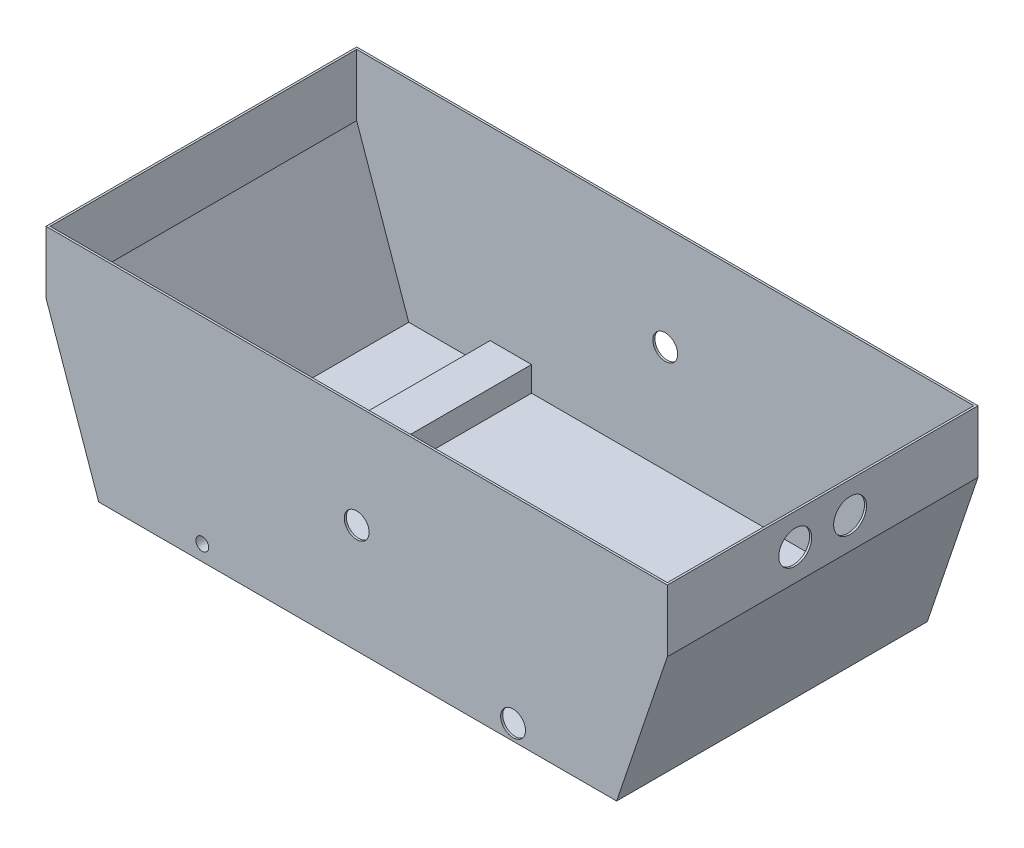
ISO-10303-21;
HEADER;
FILE_DESCRIPTION(('STEP AP214'),'2;1');
FILE_NAME('part.step','',(''),(''),'','','');
FILE_SCHEMA(('AUTOMOTIVE_DESIGN { 1 0 10303 214 1 1 1 1 }'));
ENDSEC;
DATA;
#1=APPLICATION_CONTEXT('core data for automotive mechanical design processes');
#2=APPLICATION_PROTOCOL_DEFINITION('international standard','automotive_design',2000,#1);
#3=PRODUCT_CONTEXT('',#1,'mechanical');
#4=PRODUCT('Part','Part','',(#3));
#5=PRODUCT_RELATED_PRODUCT_CATEGORY('part','',(#4));
#6=PRODUCT_DEFINITION_FORMATION('','',#4);
#7=PRODUCT_DEFINITION_CONTEXT('part definition',#1,'design');
#8=PRODUCT_DEFINITION('design','',#6,#7);
#9=PRODUCT_DEFINITION_SHAPE('','',#8);
#10=(LENGTH_UNIT() NAMED_UNIT(*) SI_UNIT(.MILLI.,.METRE.));
#11=(NAMED_UNIT(*) PLANE_ANGLE_UNIT() SI_UNIT($,.RADIAN.));
#12=(NAMED_UNIT(*) SI_UNIT($,.STERADIAN.) SOLID_ANGLE_UNIT());
#13=UNCERTAINTY_MEASURE_WITH_UNIT(LENGTH_MEASURE(1.E-05),#10,'distance_accuracy_value','');
#14=(GEOMETRIC_REPRESENTATION_CONTEXT(3) GLOBAL_UNCERTAINTY_ASSIGNED_CONTEXT((#13)) GLOBAL_UNIT_ASSIGNED_CONTEXT((#10,
#11,#12)) REPRESENTATION_CONTEXT('',''));
#15=CARTESIAN_POINT('',(0.,0.,0.));
#16=DIRECTION('',(0.,0.,1.));
#17=DIRECTION('',(1.,0.,0.));
#18=AXIS2_PLACEMENT_3D('',#15,#16,#17);
#19=CARTESIAN_POINT('',(-159.499060242563,-24.2918631799954,82.5));
#20=DIRECTION('',(0.,1.,0.));
#21=DIRECTION('',(0.,0.,1.));
#22=AXIS2_PLACEMENT_3D('',#19,#20,#21);
#23=PLANE('',#22);
#24=DIRECTION('',(1.,0.,0.));
#25=VECTOR('',#24,1.);
#26=CARTESIAN_POINT('',(-159.499060242563,-24.2918631799954,81.5));
#27=LINE('',#26,#25);
#28=CARTESIAN_POINT('',(-158.789931246237,-24.2918631799954,81.5));
#29=VERTEX_POINT('',#28);
#30=CARTESIAN_POINT('',(-119.499060242563,-24.2918631799954,81.5));
#31=VERTEX_POINT('',#30);
#32=EDGE_CURVE('E261',#29,#31,#27,.T.);
#33=ORIENTED_EDGE('',*,*,#32,.T.);
#34=DIRECTION('',(0.,0.,1.));
#35=VECTOR('',#34,1.);
#36=CARTESIAN_POINT('',(-119.499060242563,-24.2918631799954,-66.5));
#37=LINE('',#36,#35);
#38=CARTESIAN_POINT('',(-119.499060242563,-24.2918631799954,-66.5));
#39=VERTEX_POINT('',#38);
#40=EDGE_CURVE('E183',#39,#31,#37,.T.);
#41=ORIENTED_EDGE('',*,*,#40,.F.);
#42=DIRECTION('',(1.,0.,0.));
#43=VECTOR('',#42,1.);
#44=CARTESIAN_POINT('',(-159.499060242563,-24.2918631799954,-66.5));
#45=LINE('',#44,#43);
#46=CARTESIAN_POINT('',(-158.789931246237,-24.2918631799954,-66.5));
#47=VERTEX_POINT('',#46);
#48=EDGE_CURVE('E161',#47,#39,#45,.T.);
#49=ORIENTED_EDGE('',*,*,#48,.F.);
#50=DIRECTION('',(0.,0.,-1.));
#51=VECTOR('',#50,1.);
#52=CARTESIAN_POINT('',(-158.789931246237,-24.2918631799954,82.5));
#53=LINE('',#52,#51);
#54=EDGE_CURVE('E237',#29,#47,#53,.T.);
#55=ORIENTED_EDGE('',*,*,#54,.F.);
#56=EDGE_LOOP('',(#33,#41,#49,#55));
#57=FACE_BOUND('',#56,.T.);
#58=ADVANCED_FACE('F39',(#57),#23,.T.);
#59=CARTESIAN_POINT('',(-99.499060242563,-24.2918631799954,-66.5));
#60=VERTEX_POINT('',#59);
#61=CARTESIAN_POINT('',(89.8701015008835,-24.2918631799954,-66.5));
#62=VERTEX_POINT('',#61);
#63=EDGE_CURVE('E246',#60,#62,#45,.T.);
#64=ORIENTED_EDGE('',*,*,#63,.F.);
#65=DIRECTION('',(0.,0.,-1.));
#66=VECTOR('',#65,1.);
#67=CARTESIAN_POINT('',(-99.4990602425631,-24.2918631799954,81.5));
#68=LINE('',#67,#66);
#69=CARTESIAN_POINT('',(-99.499060242563,-24.2918631799954,81.5));
#70=VERTEX_POINT('',#69);
#71=EDGE_CURVE('E179',#70,#60,#68,.T.);
#72=ORIENTED_EDGE('',*,*,#71,.F.);
#73=CARTESIAN_POINT('',(89.8701015008835,-24.2918631799954,81.5));
#74=VERTEX_POINT('',#73);
#75=EDGE_CURVE('E253',#70,#74,#27,.T.);
#76=ORIENTED_EDGE('',*,*,#75,.T.);
#77=DIRECTION('',(0.,0.,-1.));
#78=VECTOR('',#77,1.);
#79=CARTESIAN_POINT('',(89.8701015008835,-24.2918631799954,82.5));
#80=LINE('',#79,#78);
#81=EDGE_CURVE('E250',#74,#62,#80,.T.);
#82=ORIENTED_EDGE('',*,*,#81,.T.);
#83=EDGE_LOOP('',(#64,#72,#76,#82));
#84=FACE_BOUND('',#83,.T.);
#85=ADVANCED_FACE('F434',(#84),#23,.T.);
#86=CARTESIAN_POINT('',(312.978085396664,-249.177523358098,81.5));
#87=DIRECTION('',(0.,0.,1.));
#88=DIRECTION('',(1.,0.,0.));
#89=AXIS2_PLACEMENT_3D('',#86,#87,#88);
#90=PLANE('',#89);
#91=CARTESIAN_POINT('',(40.5881659034325,-17.7918631799954,81.5));
#92=DIRECTION('',(0.,0.,1.));
#93=DIRECTION('',(1.,0.,0.));
#94=AXIS2_PLACEMENT_3D('',#91,#92,#93);
#95=CIRCLE('',#94,6.);
#96=CARTESIAN_POINT('',(46.5881659034325,-17.7918631799954,81.5));
#97=VERTEX_POINT('',#96);
#98=EDGE_CURVE('E219',#97,#97,#95,.T.);
#99=ORIENTED_EDGE('',*,*,#98,.T.);
#100=EDGE_LOOP('',(#99));
#101=FACE_BOUND('',#100,.T.);
#102=CARTESIAN_POINT('',(-34.9359055408862,27.2758131126307,81.5));
#103=DIRECTION('',(0.,0.,1.));
#104=DIRECTION('',(1.,0.,0.));
#105=AXIS2_PLACEMENT_3D('',#102,#103,#104);
#106=CIRCLE('',#105,6.);
#107=CARTESIAN_POINT('',(-28.9359055408862,27.2758131126307,81.5));
#108=VERTEX_POINT('',#107);
#109=EDGE_CURVE('E206',#108,#108,#106,.T.);
#110=ORIENTED_EDGE('',*,*,#109,.T.);
#111=EDGE_LOOP('',(#110));
#112=FACE_BOUND('',#111,.T.);
#113=DIRECTION('',(0.,-1.,0.));
#114=VECTOR('',#113,1.);
#115=CARTESIAN_POINT('',(-119.499060242563,-12.2918631799954,81.5));
#116=LINE('',#115,#114);
#117=CARTESIAN_POINT('',(-119.499060242563,-12.2918631799954,81.5));
#118=VERTEX_POINT('',#117);
#119=EDGE_CURVE('E166',#118,#31,#116,.T.);
#120=ORIENTED_EDGE('',*,*,#119,.T.);
#121=ORIENTED_EDGE('',*,*,#32,.F.);
#122=DIRECTION('',(0.330792465978424,-0.943703525717645,0.));
#123=VECTOR('',#122,1.);
#124=CARTESIAN_POINT('',(-183.992202015169,47.6066055786091,81.5));
#125=LINE('',#124,#123);
#126=CARTESIAN_POINT('',(-183.935905540886,47.445999800879,81.5));
#127=VERTEX_POINT('',#126);
#128=EDGE_CURVE('E242',#127,#29,#125,.T.);
#129=ORIENTED_EDGE('',*,*,#128,.F.);
#130=DIRECTION('',(0.,-1.,0.));
#131=VECTOR('',#130,1.);
#132=CARTESIAN_POINT('',(-183.935905540886,77.2758131126307,81.5));
#133=LINE('',#132,#131);
#134=CARTESIAN_POINT('',(-183.935905540886,77.2758131126307,81.5));
#135=VERTEX_POINT('',#134);
#136=EDGE_CURVE('E238',#135,#127,#133,.T.);
#137=ORIENTED_EDGE('',*,*,#136,.F.);
#138=DIRECTION('',(-1.,0.,0.));
#139=VECTOR('',#138,1.);
#140=CARTESIAN_POINT('',(-184.935905540886,77.2758131126307,81.5));
#141=LINE('',#140,#139);
#142=CARTESIAN_POINT('',(114.064094459114,77.2758131126307,81.5));
#143=VERTEX_POINT('',#142);
#144=EDGE_CURVE('E281',#143,#135,#141,.T.);
#145=ORIENTED_EDGE('',*,*,#144,.F.);
#146=DIRECTION('',(0.,1.,0.));
#147=VECTOR('',#146,1.);
#148=CARTESIAN_POINT('',(114.064094459114,77.2758131126307,81.5));
#149=LINE('',#148,#147);
#150=CARTESIAN_POINT('',(114.064094459114,47.4399138279663,81.5));
#151=VERTEX_POINT('',#150);
#152=EDGE_CURVE('E275',#151,#143,#149,.T.);
#153=ORIENTED_EDGE('',*,*,#152,.F.);
#154=DIRECTION('',(0.319595041489541,0.947554225073847,0.));
#155=VECTOR('',#154,1.);
#156=CARTESIAN_POINT('',(114.11654023404,47.5954081541202,81.5));
#157=LINE('',#156,#155);
#158=EDGE_CURVE('E265',#74,#151,#157,.T.);
#159=ORIENTED_EDGE('',*,*,#158,.F.);
#160=ORIENTED_EDGE('',*,*,#75,.F.);
#161=DIRECTION('',(0.,-1.,0.));
#162=VECTOR('',#161,1.);
#163=CARTESIAN_POINT('',(-99.4990602425631,-12.2918631799954,81.5));
#164=LINE('',#163,#162);
#165=CARTESIAN_POINT('',(-99.499060242563,-12.2918631799954,81.5));
#166=VERTEX_POINT('',#165);
#167=EDGE_CURVE('E62',#166,#70,#164,.T.);
#168=ORIENTED_EDGE('',*,*,#167,.F.);
#169=DIRECTION('',(1.,0.,0.));
#170=VECTOR('',#169,1.);
#171=CARTESIAN_POINT('',(-119.499060242563,-12.2918631799954,81.5));
#172=LINE('',#171,#170);
#173=EDGE_CURVE('E57',#118,#166,#172,.T.);
#174=ORIENTED_EDGE('',*,*,#173,.F.);
#175=EDGE_LOOP('',(#120,#121,#129,#137,#145,#153,#159,#160,#168,#174));
#176=FACE_BOUND('',#175,.T.);
#177=ADVANCED_FACE('F440',(#101,#112,#176),#90,.F.);
#178=CARTESIAN_POINT('',(312.978085396664,-249.177523358098,-66.5));
#179=DIRECTION('',(0.,0.,1.));
#180=DIRECTION('',(1.,0.,0.));
#181=AXIS2_PLACEMENT_3D('',#178,#179,#180);
#182=PLANE('',#181);
#183=CARTESIAN_POINT('',(-34.9359055408862,27.2758131126307,-66.5));
#184=DIRECTION('',(0.,0.,1.));
#185=DIRECTION('',(1.,0.,0.));
#186=AXIS2_PLACEMENT_3D('',#183,#184,#185);
#187=CIRCLE('',#186,6.);
#188=CARTESIAN_POINT('',(-28.9359055408862,27.2758131126307,-66.5));
#189=VERTEX_POINT('',#188);
#190=EDGE_CURVE('E205',#189,#189,#187,.T.);
#191=ORIENTED_EDGE('',*,*,#190,.F.);
#192=EDGE_LOOP('',(#191));
#193=FACE_BOUND('',#192,.T.);
#194=CARTESIAN_POINT('',(40.5881659034325,-17.7918631799954,-66.5));
#195=DIRECTION('',(0.,0.,1.));
#196=DIRECTION('',(1.,0.,0.));
#197=AXIS2_PLACEMENT_3D('',#194,#195,#196);
#198=CIRCLE('',#197,6.);
#199=CARTESIAN_POINT('',(46.5881659034325,-17.7918631799954,-66.5));
#200=VERTEX_POINT('',#199);
#201=EDGE_CURVE('E218',#200,#200,#198,.T.);
#202=ORIENTED_EDGE('',*,*,#201,.F.);
#203=EDGE_LOOP('',(#202));
#204=FACE_BOUND('',#203,.T.);
#205=ORIENTED_EDGE('',*,*,#48,.T.);
#206=DIRECTION('',(0.,-1.,0.));
#207=VECTOR('',#206,1.);
#208=CARTESIAN_POINT('',(-119.499060242563,-12.2918631799954,-66.5));
#209=LINE('',#208,#207);
#210=CARTESIAN_POINT('',(-119.499060242563,-12.2918631799954,-66.5));
#211=VERTEX_POINT('',#210);
#212=EDGE_CURVE('E154',#211,#39,#209,.T.);
#213=ORIENTED_EDGE('',*,*,#212,.F.);
#214=DIRECTION('',(-1.,0.,0.));
#215=VECTOR('',#214,1.);
#216=CARTESIAN_POINT('',(-99.4990602425631,-12.2918631799954,-66.5));
#217=LINE('',#216,#215);
#218=CARTESIAN_POINT('',(-99.499060242563,-12.2918631799954,-66.5));
#219=VERTEX_POINT('',#218);
#220=EDGE_CURVE('E158',#219,#211,#217,.T.);
#221=ORIENTED_EDGE('',*,*,#220,.F.);
#222=DIRECTION('',(0.,-1.,0.));
#223=VECTOR('',#222,1.);
#224=CARTESIAN_POINT('',(-99.4990602425631,-12.2918631799954,-66.5));
#225=LINE('',#224,#223);
#226=EDGE_CURVE('E193',#219,#60,#225,.T.);
#227=ORIENTED_EDGE('',*,*,#226,.T.);
#228=ORIENTED_EDGE('',*,*,#63,.T.);
#229=DIRECTION('',(0.319595041489541,0.947554225073847,0.));
#230=VECTOR('',#229,1.);
#231=CARTESIAN_POINT('',(114.11654023404,47.5954081541202,-66.5));
#232=LINE('',#231,#230);
#233=CARTESIAN_POINT('',(114.064094459114,47.4399138279663,-66.5));
#234=VERTEX_POINT('',#233);
#235=EDGE_CURVE('E256',#62,#234,#232,.T.);
#236=ORIENTED_EDGE('',*,*,#235,.T.);
#237=DIRECTION('',(0.,1.,0.));
#238=VECTOR('',#237,1.);
#239=CARTESIAN_POINT('',(114.064094459114,77.2758131126307,-66.5));
#240=LINE('',#239,#238);
#241=CARTESIAN_POINT('',(114.064094459114,77.2758131126307,-66.5));
#242=VERTEX_POINT('',#241);
#243=EDGE_CURVE('E268',#234,#242,#240,.T.);
#244=ORIENTED_EDGE('',*,*,#243,.T.);
#245=DIRECTION('',(-1.,0.,0.));
#246=VECTOR('',#245,1.);
#247=CARTESIAN_POINT('',(-184.935905540886,77.2758131126307,-66.5));
#248=LINE('',#247,#246);
#249=CARTESIAN_POINT('',(-183.935905540886,77.2758131126307,-66.5));
#250=VERTEX_POINT('',#249);
#251=EDGE_CURVE('E243',#242,#250,#248,.T.);
#252=ORIENTED_EDGE('',*,*,#251,.T.);
#253=DIRECTION('',(0.,-1.,0.));
#254=VECTOR('',#253,1.);
#255=CARTESIAN_POINT('',(-183.935905540886,77.2758131126307,-66.5));
#256=LINE('',#255,#254);
#257=CARTESIAN_POINT('',(-183.935905540886,47.445999800879,-66.5));
#258=VERTEX_POINT('',#257);
#259=EDGE_CURVE('E227',#250,#258,#256,.T.);
#260=ORIENTED_EDGE('',*,*,#259,.T.);
#261=DIRECTION('',(0.330792465978424,-0.943703525717645,0.));
#262=VECTOR('',#261,1.);
#263=CARTESIAN_POINT('',(-183.992202015169,47.6066055786091,-66.5));
#264=LINE('',#263,#262);
#265=EDGE_CURVE('E231',#258,#47,#264,.T.);
#266=ORIENTED_EDGE('',*,*,#265,.T.);
#267=EDGE_LOOP('',(#205,#213,#221,#227,#228,#236,#244,#252,#260,#266));
#268=FACE_BOUND('',#267,.T.);
#269=ADVANCED_FACE('F156',(#193,#204,#268),#182,.T.);
#270=CARTESIAN_POINT('',(-184.935905540886,77.2758131126307,82.5));
#271=DIRECTION('',(0.,-1.,0.));
#272=DIRECTION('',(0.,0.,-1.));
#273=AXIS2_PLACEMENT_3D('',#270,#271,#272);
#274=PLANE('',#273);
#275=DIRECTION('',(-1.,0.,0.));
#276=VECTOR('',#275,1.);
#277=CARTESIAN_POINT('',(-184.935905540886,77.2758131126307,-67.5));
#278=LINE('',#277,#276);
#279=CARTESIAN_POINT('',(115.064094459114,77.2758131126307,-67.5));
#280=VERTEX_POINT('',#279);
#281=CARTESIAN_POINT('',(-184.935905540886,77.2758131126307,-67.5));
#282=VERTEX_POINT('',#281);
#283=EDGE_CURVE('E299',#280,#282,#278,.T.);
#284=ORIENTED_EDGE('',*,*,#283,.T.);
#285=DIRECTION('',(0.,0.,-1.));
#286=VECTOR('',#285,1.);
#287=CARTESIAN_POINT('',(-184.935905540886,77.2758131126307,82.5));
#288=LINE('',#287,#286);
#289=CARTESIAN_POINT('',(-184.935905540886,77.2758131126307,82.5));
#290=VERTEX_POINT('',#289);
#291=EDGE_CURVE('E314',#290,#282,#288,.T.);
#292=ORIENTED_EDGE('',*,*,#291,.F.);
#293=DIRECTION('',(-1.,0.,0.));
#294=VECTOR('',#293,1.);
#295=CARTESIAN_POINT('',(-184.935905540886,77.2758131126307,82.5));
#296=LINE('',#295,#294);
#297=CARTESIAN_POINT('',(115.064094459114,77.2758131126307,82.5));
#298=VERTEX_POINT('',#297);
#299=EDGE_CURVE('E311',#298,#290,#296,.T.);
#300=ORIENTED_EDGE('',*,*,#299,.F.);
#301=DIRECTION('',(0.,0.,-1.));
#302=VECTOR('',#301,1.);
#303=CARTESIAN_POINT('',(115.064094459114,77.2758131126307,82.5));
#304=LINE('',#303,#302);
#305=EDGE_CURVE('E335',#298,#280,#304,.T.);
#306=ORIENTED_EDGE('',*,*,#305,.T.);
#307=EDGE_LOOP('',(#284,#292,#300,#306));
#308=FACE_BOUND('',#307,.T.);
#309=ORIENTED_EDGE('',*,*,#251,.F.);
#310=DIRECTION('',(0.,0.,-1.));
#311=VECTOR('',#310,1.);
#312=CARTESIAN_POINT('',(114.064094459114,77.2758131126307,82.5));
#313=LINE('',#312,#311);
#314=EDGE_CURVE('E272',#143,#242,#313,.T.);
#315=ORIENTED_EDGE('',*,*,#314,.F.);
#316=ORIENTED_EDGE('',*,*,#144,.T.);
#317=DIRECTION('',(0.,0.,-1.));
#318=VECTOR('',#317,1.);
#319=CARTESIAN_POINT('',(-183.935905540886,77.2758131126307,82.5));
#320=LINE('',#319,#318);
#321=EDGE_CURVE('E282',#135,#250,#320,.T.);
#322=ORIENTED_EDGE('',*,*,#321,.T.);
#323=EDGE_LOOP('',(#309,#315,#316,#322));
#324=FACE_BOUND('',#323,.T.);
#325=ADVANCED_FACE('F419',(#308,#324),#274,.F.);
#326=CARTESIAN_POINT('',(-184.935905540886,77.2758131126307,82.5));
#327=DIRECTION('',(1.,0.,0.));
#328=DIRECTION('',(0.,0.,-1.));
#329=AXIS2_PLACEMENT_3D('',#326,#327,#328);
#330=PLANE('',#329);
#331=DIRECTION('',(0.,-1.,0.));
#332=VECTOR('',#331,1.);
#333=CARTESIAN_POINT('',(-184.935905540886,77.2758131126307,-67.5));
#334=LINE('',#333,#332);
#335=CARTESIAN_POINT('',(-184.935905540886,47.2758131126307,-67.5));
#336=VERTEX_POINT('',#335);
#337=EDGE_CURVE('E236',#282,#336,#334,.T.);
#338=ORIENTED_EDGE('',*,*,#337,.T.);
#339=DIRECTION('',(0.,0.,-1.));
#340=VECTOR('',#339,1.);
#341=CARTESIAN_POINT('',(-184.935905540886,47.2758131126307,82.5));
#342=LINE('',#341,#340);
#343=CARTESIAN_POINT('',(-184.935905540886,47.2758131126307,82.5));
#344=VERTEX_POINT('',#343);
#345=EDGE_CURVE('E11',#344,#336,#342,.T.);
#346=ORIENTED_EDGE('',*,*,#345,.F.);
#347=DIRECTION('',(0.,-1.,0.));
#348=VECTOR('',#347,1.);
#349=CARTESIAN_POINT('',(-184.935905540886,77.2758131126307,82.5));
#350=LINE('',#349,#348);
#351=EDGE_CURVE('E294',#290,#344,#350,.T.);
#352=ORIENTED_EDGE('',*,*,#351,.F.);
#353=ORIENTED_EDGE('',*,*,#291,.T.);
#354=EDGE_LOOP('',(#338,#346,#352,#353));
#355=FACE_BOUND('',#354,.T.);
#356=ADVANCED_FACE('F41',(#355),#330,.F.);
#357=CARTESIAN_POINT('',(-184.935905540886,47.2758131126307,82.5));
#358=DIRECTION('',(0.943703525717645,0.330792465978424,0.));
#359=DIRECTION('',(-0.330792465978424,0.943703525717645,0.));
#360=AXIS2_PLACEMENT_3D('',#357,#358,#359);
#361=PLANE('',#360);
#362=DIRECTION('',(0.330792465978424,-0.943703525717645,0.));
#363=VECTOR('',#362,1.);
#364=CARTESIAN_POINT('',(-184.935905540886,47.2758131126307,-67.5));
#365=LINE('',#364,#363);
#366=CARTESIAN_POINT('',(-159.499060242563,-25.2918631799954,-67.5));
#367=VERTEX_POINT('',#366);
#368=EDGE_CURVE('E318',#336,#367,#365,.T.);
#369=ORIENTED_EDGE('',*,*,#368,.T.);
#370=DIRECTION('',(0.,0.,-1.));
#371=VECTOR('',#370,1.);
#372=CARTESIAN_POINT('',(-159.499060242563,-25.2918631799954,82.5));
#373=LINE('',#372,#371);
#374=CARTESIAN_POINT('',(-159.499060242563,-25.2918631799954,82.5));
#375=VERTEX_POINT('',#374);
#376=EDGE_CURVE('E49',#375,#367,#373,.T.);
#377=ORIENTED_EDGE('',*,*,#376,.F.);
#378=DIRECTION('',(0.330792465978424,-0.943703525717645,0.));
#379=VECTOR('',#378,1.);
#380=CARTESIAN_POINT('',(-184.935905540886,47.2758131126307,82.5));
#381=LINE('',#380,#379);
#382=EDGE_CURVE('E298',#344,#375,#381,.T.);
#383=ORIENTED_EDGE('',*,*,#382,.F.);
#384=ORIENTED_EDGE('',*,*,#345,.T.);
#385=EDGE_LOOP('',(#369,#377,#383,#384));
#386=FACE_BOUND('',#385,.T.);
#387=ADVANCED_FACE('F402',(#386),#361,.F.);
#388=CARTESIAN_POINT('',(-159.499060242563,-25.2918631799954,82.5));
#389=DIRECTION('',(0.,1.,0.));
#390=DIRECTION('',(0.,0.,1.));
#391=AXIS2_PLACEMENT_3D('',#388,#389,#390);
#392=PLANE('',#391);
#393=DIRECTION('',(1.,0.,0.));
#394=VECTOR('',#393,1.);
#395=CARTESIAN_POINT('',(-159.499060242563,-25.2918631799954,-67.5));
#396=LINE('',#395,#394);
#397=CARTESIAN_POINT('',(90.5881659034325,-25.2918631799954,-67.5));
#398=VERTEX_POINT('',#397);
#399=EDGE_CURVE('E321',#367,#398,#396,.T.);
#400=ORIENTED_EDGE('',*,*,#399,.T.);
#401=DIRECTION('',(0.,0.,-1.));
#402=VECTOR('',#401,1.);
#403=CARTESIAN_POINT('',(90.5881659034325,-25.2918631799954,82.5));
#404=LINE('',#403,#402);
#405=CARTESIAN_POINT('',(90.5881659034325,-25.2918631799954,82.5));
#406=VERTEX_POINT('',#405);
#407=EDGE_CURVE('E343',#406,#398,#404,.T.);
#408=ORIENTED_EDGE('',*,*,#407,.F.);
#409=DIRECTION('',(1.,0.,0.));
#410=VECTOR('',#409,1.);
#411=CARTESIAN_POINT('',(-159.499060242563,-25.2918631799954,82.5));
#412=LINE('',#411,#410);
#413=EDGE_CURVE('E302',#375,#406,#412,.T.);
#414=ORIENTED_EDGE('',*,*,#413,.F.);
#415=ORIENTED_EDGE('',*,*,#376,.T.);
#416=EDGE_LOOP('',(#400,#408,#414,#415));
#417=FACE_BOUND('',#416,.T.);
#418=ADVANCED_FACE('F407',(#417),#392,.F.);
#419=CARTESIAN_POINT('',(115.064094459114,47.2758131126307,82.5));
#420=DIRECTION('',(-0.947554225073847,0.319595041489541,0.));
#421=DIRECTION('',(-0.319595041489541,-0.947554225073847,0.));
#422=AXIS2_PLACEMENT_3D('',#419,#420,#421);
#423=PLANE('',#422);
#424=DIRECTION('',(0.319595041489541,0.947554225073847,0.));
#425=VECTOR('',#424,1.);
#426=CARTESIAN_POINT('',(115.064094459114,47.2758131126307,-67.5));
#427=LINE('',#426,#425);
#428=CARTESIAN_POINT('',(115.064094459114,47.2758131126307,-67.5));
#429=VERTEX_POINT('',#428);
#430=EDGE_CURVE('E324',#398,#429,#427,.T.);
#431=ORIENTED_EDGE('',*,*,#430,.T.);
#432=DIRECTION('',(0.,0.,-1.));
#433=VECTOR('',#432,1.);
#434=CARTESIAN_POINT('',(115.064094459114,47.2758131126307,82.5));
#435=LINE('',#434,#433);
#436=CARTESIAN_POINT('',(115.064094459114,47.2758131126307,82.5));
#437=VERTEX_POINT('',#436);
#438=EDGE_CURVE('E339',#437,#429,#435,.T.);
#439=ORIENTED_EDGE('',*,*,#438,.F.);
#440=DIRECTION('',(0.319595041489541,0.947554225073847,0.));
#441=VECTOR('',#440,1.);
#442=CARTESIAN_POINT('',(115.064094459114,47.2758131126307,82.5));
#443=LINE('',#442,#441);
#444=EDGE_CURVE('E305',#406,#437,#443,.T.);
#445=ORIENTED_EDGE('',*,*,#444,.F.);
#446=ORIENTED_EDGE('',*,*,#407,.T.);
#447=EDGE_LOOP('',(#431,#439,#445,#446));
#448=FACE_BOUND('',#447,.T.);
#449=ADVANCED_FACE('F413',(#448),#423,.F.);
#450=CARTESIAN_POINT('',(115.064094459114,77.2758131126307,82.5));
#451=DIRECTION('',(-1.,0.,0.));
#452=DIRECTION('',(0.,0.,1.));
#453=AXIS2_PLACEMENT_3D('',#450,#451,#452);
#454=PLANE('',#453);
#455=CARTESIAN_POINT('',(115.064094459114,62.2758131126307,20.75));
#456=DIRECTION('',(1.,0.,0.));
#457=DIRECTION('',(0.,0.,-1.));
#458=AXIS2_PLACEMENT_3D('',#455,#456,#457);
#459=CIRCLE('',#458,7.95);
#460=CARTESIAN_POINT('',(115.064094459114,62.2758131126307,12.8));
#461=VERTEX_POINT('',#460);
#462=EDGE_CURVE('E358',#461,#461,#459,.T.);
#463=ORIENTED_EDGE('',*,*,#462,.F.);
#464=EDGE_LOOP('',(#463));
#465=FACE_BOUND('',#464,.T.);
#466=CARTESIAN_POINT('',(115.064094459114,62.2758131126307,-5.74999999999999));
#467=DIRECTION('',(1.,0.,0.));
#468=DIRECTION('',(0.,0.,-1.));
#469=AXIS2_PLACEMENT_3D('',#466,#467,#468);
#470=CIRCLE('',#469,7.95);
#471=CARTESIAN_POINT('',(115.064094459114,62.2758131126307,-13.7));
#472=VERTEX_POINT('',#471);
#473=EDGE_CURVE('E366',#472,#472,#470,.T.);
#474=ORIENTED_EDGE('',*,*,#473,.F.);
#475=EDGE_LOOP('',(#474));
#476=FACE_BOUND('',#475,.T.);
#477=DIRECTION('',(0.,1.,0.));
#478=VECTOR('',#477,1.);
#479=CARTESIAN_POINT('',(115.064094459114,77.2758131126307,-67.5));
#480=LINE('',#479,#478);
#481=EDGE_CURVE('E327',#429,#280,#480,.T.);
#482=ORIENTED_EDGE('',*,*,#481,.T.);
#483=ORIENTED_EDGE('',*,*,#305,.F.);
#484=DIRECTION('',(0.,1.,0.));
#485=VECTOR('',#484,1.);
#486=CARTESIAN_POINT('',(115.064094459114,77.2758131126307,82.5));
#487=LINE('',#486,#485);
#488=EDGE_CURVE('E308',#437,#298,#487,.T.);
#489=ORIENTED_EDGE('',*,*,#488,.F.);
#490=ORIENTED_EDGE('',*,*,#438,.T.);
#491=EDGE_LOOP('',(#482,#483,#489,#490));
#492=FACE_BOUND('',#491,.T.);
#493=ADVANCED_FACE('F388',(#465,#476,#492),#454,.F.);
#494=CARTESIAN_POINT('',(312.978085396664,-249.177523358098,82.5));
#495=DIRECTION('',(0.,0.,1.));
#496=DIRECTION('',(1.,0.,0.));
#497=AXIS2_PLACEMENT_3D('',#494,#495,#496);
#498=PLANE('',#497);
#499=CARTESIAN_POINT('',(-109.499060242563,-17.7918631799954,82.5));
#500=DIRECTION('',(0.,0.,1.));
#501=DIRECTION('',(1.,0.,0.));
#502=AXIS2_PLACEMENT_3D('',#499,#500,#501);
#503=CIRCLE('',#502,3.1);
#504=CARTESIAN_POINT('',(-106.399060242563,-17.7918631799954,82.5));
#505=VERTEX_POINT('',#504);
#506=EDGE_CURVE('E186',#505,#505,#503,.T.);
#507=ORIENTED_EDGE('',*,*,#506,.F.);
#508=EDGE_LOOP('',(#507));
#509=FACE_BOUND('',#508,.T.);
#510=CARTESIAN_POINT('',(-34.9359055408862,27.2758131126307,82.5));
#511=DIRECTION('',(0.,0.,1.));
#512=DIRECTION('',(1.,0.,0.));
#513=AXIS2_PLACEMENT_3D('',#510,#511,#512);
#514=CIRCLE('',#513,6.);
#515=CARTESIAN_POINT('',(-28.9359055408862,27.2758131126307,82.5));
#516=VERTEX_POINT('',#515);
#517=EDGE_CURVE('E210',#516,#516,#514,.T.);
#518=ORIENTED_EDGE('',*,*,#517,.F.);
#519=EDGE_LOOP('',(#518));
#520=FACE_BOUND('',#519,.T.);
#521=CARTESIAN_POINT('',(40.5881659034325,-17.7918631799954,82.5));
#522=DIRECTION('',(0.,0.,-1.));
#523=DIRECTION('',(-1.,0.,0.));
#524=AXIS2_PLACEMENT_3D('',#521,#522,#523);
#525=CIRCLE('',#524,6.);
#526=CARTESIAN_POINT('',(34.5881659034325,-17.7918631799954,82.5));
#527=VERTEX_POINT('',#526);
#528=EDGE_CURVE('E214',#527,#527,#525,.T.);
#529=ORIENTED_EDGE('',*,*,#528,.T.);
#530=EDGE_LOOP('',(#529));
#531=FACE_BOUND('',#530,.T.);
#532=ORIENTED_EDGE('',*,*,#351,.T.);
#533=ORIENTED_EDGE('',*,*,#382,.T.);
#534=ORIENTED_EDGE('',*,*,#413,.T.);
#535=ORIENTED_EDGE('',*,*,#444,.T.);
#536=ORIENTED_EDGE('',*,*,#488,.T.);
#537=ORIENTED_EDGE('',*,*,#299,.T.);
#538=EDGE_LOOP('',(#532,#533,#534,#535,#536,#537));
#539=FACE_BOUND('',#538,.T.);
#540=ADVANCED_FACE('F384',(#509,#520,#531,#539),#498,.T.);
#541=CARTESIAN_POINT('',(312.978085396664,-249.177523358098,-67.5));
#542=DIRECTION('',(0.,0.,1.));
#543=DIRECTION('',(1.,0.,0.));
#544=AXIS2_PLACEMENT_3D('',#541,#542,#543);
#545=PLANE('',#544);
#546=CARTESIAN_POINT('',(-109.499060242563,-17.7918631799954,-67.5));
#547=DIRECTION('',(0.,0.,1.));
#548=DIRECTION('',(1.,0.,0.));
#549=AXIS2_PLACEMENT_3D('',#546,#547,#548);
#550=CIRCLE('',#549,3.1);
#551=CARTESIAN_POINT('',(-106.399060242563,-17.7918631799954,-67.5));
#552=VERTEX_POINT('',#551);
#553=EDGE_CURVE('E364',#552,#552,#550,.T.);
#554=ORIENTED_EDGE('',*,*,#553,.T.);
#555=EDGE_LOOP('',(#554));
#556=FACE_BOUND('',#555,.T.);
#557=CARTESIAN_POINT('',(-34.9359055408862,27.2758131126307,-67.5));
#558=DIRECTION('',(0.,0.,1.));
#559=DIRECTION('',(1.,0.,0.));
#560=AXIS2_PLACEMENT_3D('',#557,#558,#559);
#561=CIRCLE('',#560,6.);
#562=CARTESIAN_POINT('',(-28.9359055408862,27.2758131126307,-67.5));
#563=VERTEX_POINT('',#562);
#564=EDGE_CURVE('E165',#563,#563,#561,.T.);
#565=ORIENTED_EDGE('',*,*,#564,.T.);
#566=EDGE_LOOP('',(#565));
#567=FACE_BOUND('',#566,.T.);
#568=CARTESIAN_POINT('',(40.5881659034325,-17.7918631799954,-67.5));
#569=DIRECTION('',(0.,0.,1.));
#570=DIRECTION('',(1.,0.,0.));
#571=AXIS2_PLACEMENT_3D('',#568,#569,#570);
#572=CIRCLE('',#571,6.);
#573=CARTESIAN_POINT('',(46.5881659034325,-17.7918631799954,-67.5));
#574=VERTEX_POINT('',#573);
#575=EDGE_CURVE('E223',#574,#574,#572,.T.);
#576=ORIENTED_EDGE('',*,*,#575,.T.);
#577=EDGE_LOOP('',(#576));
#578=FACE_BOUND('',#577,.T.);
#579=ORIENTED_EDGE('',*,*,#337,.F.);
#580=ORIENTED_EDGE('',*,*,#283,.F.);
#581=ORIENTED_EDGE('',*,*,#481,.F.);
#582=ORIENTED_EDGE('',*,*,#430,.F.);
#583=ORIENTED_EDGE('',*,*,#399,.F.);
#584=ORIENTED_EDGE('',*,*,#368,.F.);
#585=EDGE_LOOP('',(#579,#580,#581,#582,#583,#584));
#586=FACE_BOUND('',#585,.T.);
#587=ADVANCED_FACE('F387',(#556,#567,#578,#586),#545,.F.);
#588=CARTESIAN_POINT('',(-183.935905540886,77.2758131126307,82.5));
#589=DIRECTION('',(1.,0.,0.));
#590=DIRECTION('',(0.,0.,-1.));
#591=AXIS2_PLACEMENT_3D('',#588,#589,#590);
#592=PLANE('',#591);
#593=ORIENTED_EDGE('',*,*,#259,.F.);
#594=ORIENTED_EDGE('',*,*,#321,.F.);
#595=ORIENTED_EDGE('',*,*,#136,.T.);
#596=DIRECTION('',(0.,0.,-1.));
#597=VECTOR('',#596,1.);
#598=CARTESIAN_POINT('',(-183.935905540886,47.445999800879,82.5));
#599=LINE('',#598,#597);
#600=EDGE_CURVE('E232',#127,#258,#599,.T.);
#601=ORIENTED_EDGE('',*,*,#600,.T.);
#602=EDGE_LOOP('',(#593,#594,#595,#601));
#603=FACE_BOUND('',#602,.T.);
#604=ADVANCED_FACE('F423',(#603),#592,.T.);
#605=CARTESIAN_POINT('',(-183.992202015169,47.6066055786091,82.5));
#606=DIRECTION('',(0.943703525717645,0.330792465978424,0.));
#607=DIRECTION('',(-0.330792465978424,0.943703525717645,0.));
#608=AXIS2_PLACEMENT_3D('',#605,#606,#607);
#609=PLANE('',#608);
#610=ORIENTED_EDGE('',*,*,#265,.F.);
#611=ORIENTED_EDGE('',*,*,#600,.F.);
#612=ORIENTED_EDGE('',*,*,#128,.T.);
#613=ORIENTED_EDGE('',*,*,#54,.T.);
#614=EDGE_LOOP('',(#610,#611,#612,#613));
#615=FACE_BOUND('',#614,.T.);
#616=ADVANCED_FACE('F428',(#615),#609,.T.);
#617=CARTESIAN_POINT('',(114.11654023404,47.5954081541202,82.5));
#618=DIRECTION('',(-0.947554225073847,0.319595041489541,0.));
#619=DIRECTION('',(-0.319595041489541,-0.947554225073847,0.));
#620=AXIS2_PLACEMENT_3D('',#617,#618,#619);
#621=PLANE('',#620);
#622=ORIENTED_EDGE('',*,*,#235,.F.);
#623=ORIENTED_EDGE('',*,*,#81,.F.);
#624=ORIENTED_EDGE('',*,*,#158,.T.);
#625=DIRECTION('',(0.,0.,-1.));
#626=VECTOR('',#625,1.);
#627=CARTESIAN_POINT('',(114.064094459114,47.4399138279663,82.5));
#628=LINE('',#627,#626);
#629=EDGE_CURVE('E260',#151,#234,#628,.T.);
#630=ORIENTED_EDGE('',*,*,#629,.T.);
#631=EDGE_LOOP('',(#622,#623,#624,#630));
#632=FACE_BOUND('',#631,.T.);
#633=ADVANCED_FACE('F444',(#632),#621,.T.);
#634=CARTESIAN_POINT('',(114.064094459114,77.2758131126307,82.5));
#635=DIRECTION('',(-1.,0.,0.));
#636=DIRECTION('',(0.,0.,1.));
#637=AXIS2_PLACEMENT_3D('',#634,#635,#636);
#638=PLANE('',#637);
#639=CARTESIAN_POINT('',(114.064094459114,62.2758131126307,20.75));
#640=DIRECTION('',(-1.,0.,0.));
#641=DIRECTION('',(0.,0.,1.));
#642=AXIS2_PLACEMENT_3D('',#639,#640,#641);
#643=CIRCLE('',#642,7.95);
#644=CARTESIAN_POINT('',(114.064094459114,62.2758131126307,28.7));
#645=VERTEX_POINT('',#644);
#646=EDGE_CURVE('E43',#645,#645,#643,.T.);
#647=ORIENTED_EDGE('',*,*,#646,.F.);
#648=EDGE_LOOP('',(#647));
#649=FACE_BOUND('',#648,.T.);
#650=CARTESIAN_POINT('',(114.064094459114,62.2758131126307,-5.74999999999999));
#651=DIRECTION('',(-1.,0.,0.));
#652=DIRECTION('',(0.,0.,1.));
#653=AXIS2_PLACEMENT_3D('',#650,#651,#652);
#654=CIRCLE('',#653,7.95);
#655=CARTESIAN_POINT('',(114.064094459114,62.2758131126307,2.20000000000001));
#656=VERTEX_POINT('',#655);
#657=EDGE_CURVE('E355',#656,#656,#654,.T.);
#658=ORIENTED_EDGE('',*,*,#657,.F.);
#659=EDGE_LOOP('',(#658));
#660=FACE_BOUND('',#659,.T.);
#661=ORIENTED_EDGE('',*,*,#243,.F.);
#662=ORIENTED_EDGE('',*,*,#629,.F.);
#663=ORIENTED_EDGE('',*,*,#152,.T.);
#664=ORIENTED_EDGE('',*,*,#314,.T.);
#665=EDGE_LOOP('',(#661,#662,#663,#664));
#666=FACE_BOUND('',#665,.T.);
#667=ADVANCED_FACE('F447',(#649,#660,#666),#638,.T.);
#668=CARTESIAN_POINT('',(40.5881659034325,-17.7918631799954,82.5));
#669=DIRECTION('',(0.,0.,-1.));
#670=DIRECTION('',(-1.,0.,0.));
#671=AXIS2_PLACEMENT_3D('',#668,#669,#670);
#672=CYLINDRICAL_SURFACE('',#671,6.);
#673=ORIENTED_EDGE('',*,*,#201,.T.);
#674=EDGE_LOOP('',(#673));
#675=FACE_BOUND('',#674,.T.);
#676=ORIENTED_EDGE('',*,*,#575,.F.);
#677=EDGE_LOOP('',(#676));
#678=FACE_BOUND('',#677,.T.);
#679=ADVANCED_FACE('F451',(#675,#678),#672,.F.);
#680=ORIENTED_EDGE('',*,*,#528,.F.);
#681=EDGE_LOOP('',(#680));
#682=FACE_BOUND('',#681,.T.);
#683=ORIENTED_EDGE('',*,*,#98,.F.);
#684=EDGE_LOOP('',(#683));
#685=FACE_BOUND('',#684,.T.);
#686=ADVANCED_FACE('F467',(#682,#685),#672,.F.);
#687=CARTESIAN_POINT('',(-34.9359055408862,27.2758131126307,-67.5));
#688=DIRECTION('',(0.,0.,1.));
#689=DIRECTION('',(1.,0.,0.));
#690=AXIS2_PLACEMENT_3D('',#687,#688,#689);
#691=CYLINDRICAL_SURFACE('',#690,6.);
#692=ORIENTED_EDGE('',*,*,#190,.T.);
#693=EDGE_LOOP('',(#692));
#694=FACE_BOUND('',#693,.T.);
#695=ORIENTED_EDGE('',*,*,#564,.F.);
#696=EDGE_LOOP('',(#695));
#697=FACE_BOUND('',#696,.T.);
#698=ADVANCED_FACE('F474',(#694,#697),#691,.F.);
#699=ORIENTED_EDGE('',*,*,#517,.T.);
#700=EDGE_LOOP('',(#699));
#701=FACE_BOUND('',#700,.T.);
#702=ORIENTED_EDGE('',*,*,#109,.F.);
#703=EDGE_LOOP('',(#702));
#704=FACE_BOUND('',#703,.T.);
#705=ADVANCED_FACE('F479',(#701,#704),#691,.F.);
#706=CARTESIAN_POINT('',(-119.499060242563,-12.2918631799954,-66.5));
#707=DIRECTION('',(1.,0.,0.));
#708=DIRECTION('',(0.,0.,-1.));
#709=AXIS2_PLACEMENT_3D('',#706,#707,#708);
#710=PLANE('',#709);
#711=ORIENTED_EDGE('',*,*,#40,.T.);
#712=ORIENTED_EDGE('',*,*,#119,.F.);
#713=DIRECTION('',(0.,0.,1.));
#714=VECTOR('',#713,1.);
#715=CARTESIAN_POINT('',(-119.499060242563,-12.2918631799954,-66.5));
#716=LINE('',#715,#714);
#717=EDGE_CURVE('E169',#211,#118,#716,.T.);
#718=ORIENTED_EDGE('',*,*,#717,.F.);
#719=ORIENTED_EDGE('',*,*,#212,.T.);
#720=EDGE_LOOP('',(#711,#712,#718,#719));
#721=FACE_BOUND('',#720,.T.);
#722=ADVANCED_FACE('F170',(#721),#710,.F.);
#723=CARTESIAN_POINT('',(-99.4990602425631,-12.2918631799954,81.5));
#724=DIRECTION('',(-1.,0.,0.));
#725=DIRECTION('',(0.,0.,1.));
#726=AXIS2_PLACEMENT_3D('',#723,#724,#725);
#727=PLANE('',#726);
#728=ORIENTED_EDGE('',*,*,#71,.T.);
#729=ORIENTED_EDGE('',*,*,#226,.F.);
#730=DIRECTION('',(0.,0.,-1.));
#731=VECTOR('',#730,1.);
#732=CARTESIAN_POINT('',(-99.4990602425631,-12.2918631799954,81.5));
#733=LINE('',#732,#731);
#734=EDGE_CURVE('E176',#166,#219,#733,.T.);
#735=ORIENTED_EDGE('',*,*,#734,.F.);
#736=ORIENTED_EDGE('',*,*,#167,.T.);
#737=EDGE_LOOP('',(#728,#729,#735,#736));
#738=FACE_BOUND('',#737,.T.);
#739=ADVANCED_FACE('F483',(#738),#727,.F.);
#740=CARTESIAN_POINT('',(0.,-12.2918631799954,0.));
#741=DIRECTION('',(0.,1.,0.));
#742=DIRECTION('',(0.,0.,1.));
#743=AXIS2_PLACEMENT_3D('',#740,#741,#742);
#744=PLANE('',#743);
#745=ORIENTED_EDGE('',*,*,#220,.T.);
#746=ORIENTED_EDGE('',*,*,#717,.T.);
#747=ORIENTED_EDGE('',*,*,#173,.T.);
#748=ORIENTED_EDGE('',*,*,#734,.T.);
#749=EDGE_LOOP('',(#745,#746,#747,#748));
#750=FACE_BOUND('',#749,.T.);
#751=ADVANCED_FACE('F174',(#750),#744,.T.);
#752=CARTESIAN_POINT('',(-109.499060242563,-17.7918631799954,-67.5));
#753=DIRECTION('',(0.,0.,1.));
#754=DIRECTION('',(1.,0.,0.));
#755=AXIS2_PLACEMENT_3D('',#752,#753,#754);
#756=CYLINDRICAL_SURFACE('',#755,3.1);
#757=ORIENTED_EDGE('',*,*,#506,.T.);
#758=EDGE_LOOP('',(#757));
#759=FACE_BOUND('',#758,.T.);
#760=ORIENTED_EDGE('',*,*,#553,.F.);
#761=EDGE_LOOP('',(#760));
#762=FACE_BOUND('',#761,.T.);
#763=ADVANCED_FACE('F381',(#759,#762),#756,.F.);
#764=CARTESIAN_POINT('',(113.064094459114,62.2758131126307,-5.74999999999999));
#765=DIRECTION('',(1.,0.,0.));
#766=DIRECTION('',(0.,0.,-1.));
#767=AXIS2_PLACEMENT_3D('',#764,#765,#766);
#768=CYLINDRICAL_SURFACE('',#767,7.95);
#769=ORIENTED_EDGE('',*,*,#657,.T.);
#770=EDGE_LOOP('',(#769));
#771=FACE_BOUND('',#770,.T.);
#772=ORIENTED_EDGE('',*,*,#473,.T.);
#773=EDGE_LOOP('',(#772));
#774=FACE_BOUND('',#773,.T.);
#775=ADVANCED_FACE('F491',(#771,#774),#768,.F.);
#776=CARTESIAN_POINT('',(113.064094459114,62.2758131126307,20.75));
#777=DIRECTION('',(1.,0.,0.));
#778=DIRECTION('',(0.,0.,-1.));
#779=AXIS2_PLACEMENT_3D('',#776,#777,#778);
#780=CYLINDRICAL_SURFACE('',#779,7.95);
#781=ORIENTED_EDGE('',*,*,#646,.T.);
#782=EDGE_LOOP('',(#781));
#783=FACE_BOUND('',#782,.T.);
#784=ORIENTED_EDGE('',*,*,#462,.T.);
#785=EDGE_LOOP('',(#784));
#786=FACE_BOUND('',#785,.T.);
#787=ADVANCED_FACE('F494',(#783,#786),#780,.F.);
#788=CLOSED_SHELL('',(#58,#85,#177,#269,#325,#356,#387,#418,#449,#493,#540,#587,#604,#616,#633,
#667,#679,#686,#698,#705,#722,#739,#751,#763,#775,#787));
#789=MANIFOLD_SOLID_BREP('B2',#788);
#790=ADVANCED_BREP_SHAPE_REPRESENTATION('',(#18,#789),#14);
#791=SHAPE_DEFINITION_REPRESENTATION(#9,#790);
ENDSEC;
END-ISO-10303-21;
